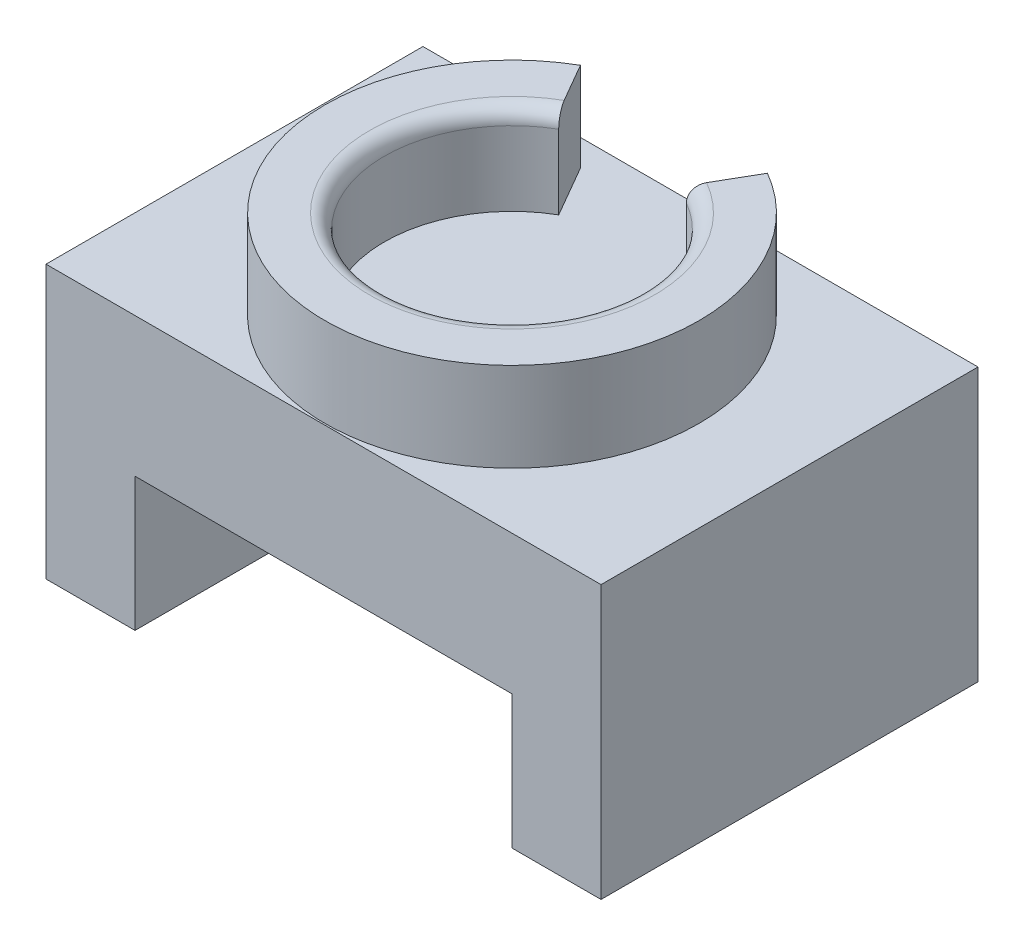
ISO-10303-21;
HEADER;
FILE_DESCRIPTION(('STEP AP214'),'2;1');
FILE_NAME('part.step','',(''),(''),'','','');
FILE_SCHEMA(('AUTOMOTIVE_DESIGN { 1 0 10303 214 1 1 1 1 }'));
ENDSEC;
DATA;
#1=APPLICATION_CONTEXT('core data for automotive mechanical design processes');
#2=APPLICATION_PROTOCOL_DEFINITION('international standard','automotive_design',2000,#1);
#3=PRODUCT_CONTEXT('',#1,'mechanical');
#4=PRODUCT('Part','Part','',(#3));
#5=PRODUCT_RELATED_PRODUCT_CATEGORY('part','',(#4));
#6=PRODUCT_DEFINITION_FORMATION('','',#4);
#7=PRODUCT_DEFINITION_CONTEXT('part definition',#1,'design');
#8=PRODUCT_DEFINITION('design','',#6,#7);
#9=PRODUCT_DEFINITION_SHAPE('','',#8);
#10=(LENGTH_UNIT() NAMED_UNIT(*) SI_UNIT(.MILLI.,.METRE.));
#11=(NAMED_UNIT(*) PLANE_ANGLE_UNIT() SI_UNIT($,.RADIAN.));
#12=(NAMED_UNIT(*) SI_UNIT($,.STERADIAN.) SOLID_ANGLE_UNIT());
#13=UNCERTAINTY_MEASURE_WITH_UNIT(LENGTH_MEASURE(1.E-05),#10,'distance_accuracy_value','');
#14=(GEOMETRIC_REPRESENTATION_CONTEXT(3) GLOBAL_UNCERTAINTY_ASSIGNED_CONTEXT((#13)) GLOBAL_UNIT_ASSIGNED_CONTEXT((#10,
#11,#12)) REPRESENTATION_CONTEXT('',''));
#15=CARTESIAN_POINT('',(0.,0.,0.));
#16=DIRECTION('',(0.,0.,1.));
#17=DIRECTION('',(1.,0.,0.));
#18=AXIS2_PLACEMENT_3D('',#15,#16,#17);
#19=CARTESIAN_POINT('',(2.51046511627907,24.375,12.7));
#20=DIRECTION('',(0.,1.,0.));
#21=DIRECTION('',(-1.,0.,0.));
#22=AXIS2_PLACEMENT_3D('',#19,#20,#21);
#23=PLANE('',#22);
#24=DIRECTION('',(0.500000000000001,0.,-0.866025403784438));
#25=VECTOR('',#24,1.);
#26=CARTESIAN_POINT('',(7.38211015124049,24.375,4.26206328300618));
#27=LINE('',#26,#25);
#28=CARTESIAN_POINT('',(7.31046511627908,24.375,4.38615612366939));
#29=VERTEX_POINT('',#28);
#30=CARTESIAN_POINT('',(8.81046511627909,24.375,1.78807991231608));
#31=VERTEX_POINT('',#30);
#32=EDGE_CURVE('E268',#29,#31,#27,.T.);
#33=ORIENTED_EDGE('',*,*,#32,.F.);
#34=CARTESIAN_POINT('',(2.51046511627907,24.375,12.7));
#35=DIRECTION('',(0.,1.,0.));
#36=DIRECTION('',(-1.,0.,0.));
#37=AXIS2_PLACEMENT_3D('',#34,#35,#36);
#38=CIRCLE('',#37,9.6);
#39=CARTESIAN_POINT('',(-2.28953488372094,24.375,4.38615612366939));
#40=VERTEX_POINT('',#39);
#41=EDGE_CURVE('E48',#29,#40,#38,.F.);
#42=ORIENTED_EDGE('',*,*,#41,.T.);
#43=DIRECTION('',(-0.500000000000001,0.,-0.866025403784438));
#44=VECTOR('',#43,1.);
#45=CARTESIAN_POINT('',(-3.61641247682189,24.375,2.08793671699385));
#46=LINE('',#45,#44);
#47=CARTESIAN_POINT('',(-3.78953488372094,24.375,1.78807991231608));
#48=VERTEX_POINT('',#47);
#49=EDGE_CURVE('E265',#40,#48,#46,.T.);
#50=ORIENTED_EDGE('',*,*,#49,.T.);
#51=CARTESIAN_POINT('',(2.51046511627907,24.375,12.7));
#52=DIRECTION('',(0.,1.,0.));
#53=DIRECTION('',(-1.,0.,0.));
#54=AXIS2_PLACEMENT_3D('',#51,#52,#53);
#55=CIRCLE('',#54,12.6);
#56=EDGE_CURVE('E159',#48,#31,#55,.T.);
#57=ORIENTED_EDGE('',*,*,#56,.T.);
#58=EDGE_LOOP('',(#33,#42,#50,#57));
#59=FACE_BOUND('',#58,.T.);
#60=ADVANCED_FACE('F39',(#59),#23,.T.);
#61=CARTESIAN_POINT('',(2.51046511627907,24.375,12.7));
#62=DIRECTION('',(0.,-1.,0.));
#63=DIRECTION('',(1.,0.,0.));
#64=AXIS2_PLACEMENT_3D('',#61,#62,#63);
#65=CYLINDRICAL_SURFACE('',#64,12.6);
#66=DIRECTION('',(0.,1.,0.));
#67=VECTOR('',#66,1.);
#68=CARTESIAN_POINT('',(-3.78953488372094,18.375,1.78807991231608));
#69=LINE('',#68,#67);
#70=CARTESIAN_POINT('',(-3.78953488372094,18.375,1.78807991231608));
#71=VERTEX_POINT('',#70);
#72=EDGE_CURVE('E160',#71,#48,#69,.T.);
#73=ORIENTED_EDGE('',*,*,#72,.F.);
#74=CARTESIAN_POINT('',(2.51046511627907,18.375,12.7));
#75=DIRECTION('',(0.,-1.,0.));
#76=DIRECTION('',(1.,0.,0.));
#77=AXIS2_PLACEMENT_3D('',#74,#75,#76);
#78=CIRCLE('',#77,12.6);
#79=CARTESIAN_POINT('',(8.81046511627909,18.375,1.78807991231608));
#80=VERTEX_POINT('',#79);
#81=EDGE_CURVE('E252',#71,#80,#78,.F.);
#82=ORIENTED_EDGE('',*,*,#81,.T.);
#83=DIRECTION('',(0.,1.,0.));
#84=VECTOR('',#83,1.);
#85=CARTESIAN_POINT('',(8.81046511627909,18.375,1.78807991231608));
#86=LINE('',#85,#84);
#87=EDGE_CURVE('E136',#80,#31,#86,.T.);
#88=ORIENTED_EDGE('',*,*,#87,.T.);
#89=ORIENTED_EDGE('',*,*,#56,.F.);
#90=EDGE_LOOP('',(#73,#82,#88,#89));
#91=FACE_BOUND('',#90,.T.);
#92=ADVANCED_FACE('F261',(#91),#65,.T.);
#93=CARTESIAN_POINT('',(2.51046511627907,24.375,12.7));
#94=DIRECTION('',(0.,-1.,0.));
#95=DIRECTION('',(1.,0.,0.));
#96=AXIS2_PLACEMENT_3D('',#93,#94,#95);
#97=CYLINDRICAL_SURFACE('',#96,8.6);
#98=DIRECTION('',(0.,1.,0.));
#99=VECTOR('',#98,1.);
#100=CARTESIAN_POINT('',(-1.78953488372094,18.375,5.25218152745383));
#101=LINE('',#100,#99);
#102=CARTESIAN_POINT('',(-1.78953488372094,18.375,5.25218152745383));
#103=VERTEX_POINT('',#102);
#104=CARTESIAN_POINT('',(-1.78953488372094,23.375,5.25218152745383));
#105=VERTEX_POINT('',#104);
#106=EDGE_CURVE('E142',#103,#105,#101,.T.);
#107=ORIENTED_EDGE('',*,*,#106,.T.);
#108=CARTESIAN_POINT('',(2.51046511627907,23.375,12.7));
#109=DIRECTION('',(0.,1.,0.));
#110=DIRECTION('',(-1.,0.,0.));
#111=AXIS2_PLACEMENT_3D('',#108,#109,#110);
#112=CIRCLE('',#111,8.6);
#113=CARTESIAN_POINT('',(6.81046511627908,23.375,5.25218152745383));
#114=VERTEX_POINT('',#113);
#115=EDGE_CURVE('E152',#105,#114,#112,.T.);
#116=ORIENTED_EDGE('',*,*,#115,.T.);
#117=DIRECTION('',(0.,1.,0.));
#118=VECTOR('',#117,1.);
#119=CARTESIAN_POINT('',(6.81046511627908,18.375,5.25218152745383));
#120=LINE('',#119,#118);
#121=CARTESIAN_POINT('',(6.81046511627908,18.375,5.25218152745383));
#122=VERTEX_POINT('',#121);
#123=EDGE_CURVE('E134',#122,#114,#120,.T.);
#124=ORIENTED_EDGE('',*,*,#123,.F.);
#125=CARTESIAN_POINT('',(2.51046511627907,18.375,12.7));
#126=DIRECTION('',(0.,1.,0.));
#127=DIRECTION('',(-1.,0.,0.));
#128=AXIS2_PLACEMENT_3D('',#125,#126,#127);
#129=CIRCLE('',#128,8.6);
#130=EDGE_CURVE('E150',#103,#122,#129,.T.);
#131=ORIENTED_EDGE('',*,*,#130,.F.);
#132=EDGE_LOOP('',(#107,#116,#124,#131));
#133=FACE_BOUND('',#132,.T.);
#134=ADVANCED_FACE('F149',(#133),#97,.F.);
#135=CARTESIAN_POINT('',(-16.1895348837209,0.,25.4));
#136=DIRECTION('',(0.,1.,0.));
#137=DIRECTION('',(0.,0.,1.));
#138=AXIS2_PLACEMENT_3D('',#135,#136,#137);
#139=PLANE('',#138);
#140=DIRECTION('',(1.,0.,0.));
#141=VECTOR('',#140,1.);
#142=CARTESIAN_POINT('',(-16.1895348837209,0.,0.));
#143=LINE('',#142,#141);
#144=CARTESIAN_POINT('',(-16.1895348837209,0.,0.));
#145=VERTEX_POINT('',#144);
#146=CARTESIAN_POINT('',(-10.1895348837209,0.,0.));
#147=VERTEX_POINT('',#146);
#148=EDGE_CURVE('E165',#145,#147,#143,.T.);
#149=ORIENTED_EDGE('',*,*,#148,.T.);
#150=DIRECTION('',(0.,0.,-1.));
#151=VECTOR('',#150,1.);
#152=CARTESIAN_POINT('',(-10.1895348837209,0.,25.4));
#153=LINE('',#152,#151);
#154=CARTESIAN_POINT('',(-10.1895348837209,0.,25.4));
#155=VERTEX_POINT('',#154);
#156=EDGE_CURVE('E248',#155,#147,#153,.T.);
#157=ORIENTED_EDGE('',*,*,#156,.F.);
#158=DIRECTION('',(1.,0.,0.));
#159=VECTOR('',#158,1.);
#160=CARTESIAN_POINT('',(-16.1895348837209,0.,25.4));
#161=LINE('',#160,#159);
#162=CARTESIAN_POINT('',(-16.1895348837209,0.,25.4));
#163=VERTEX_POINT('',#162);
#164=EDGE_CURVE('E171',#163,#155,#161,.T.);
#165=ORIENTED_EDGE('',*,*,#164,.F.);
#166=DIRECTION('',(0.,0.,-1.));
#167=VECTOR('',#166,1.);
#168=CARTESIAN_POINT('',(-16.1895348837209,0.,25.4));
#169=LINE('',#168,#167);
#170=EDGE_CURVE('E197',#163,#145,#169,.T.);
#171=ORIENTED_EDGE('',*,*,#170,.T.);
#172=EDGE_LOOP('',(#149,#157,#165,#171));
#173=FACE_BOUND('',#172,.T.);
#174=ADVANCED_FACE('F324',(#173),#139,.F.);
#175=CARTESIAN_POINT('',(-10.1895348837209,0.,25.4));
#176=DIRECTION('',(-1.,0.,0.));
#177=DIRECTION('',(0.,0.,1.));
#178=AXIS2_PLACEMENT_3D('',#175,#176,#177);
#179=PLANE('',#178);
#180=DIRECTION('',(0.,1.,0.));
#181=VECTOR('',#180,1.);
#182=CARTESIAN_POINT('',(-10.1895348837209,0.,0.));
#183=LINE('',#182,#181);
#184=CARTESIAN_POINT('',(-10.1895348837209,9.,0.));
#185=VERTEX_POINT('',#184);
#186=EDGE_CURVE('E201',#147,#185,#183,.T.);
#187=ORIENTED_EDGE('',*,*,#186,.T.);
#188=DIRECTION('',(0.,0.,-1.));
#189=VECTOR('',#188,1.);
#190=CARTESIAN_POINT('',(-10.1895348837209,9.,25.4));
#191=LINE('',#190,#189);
#192=CARTESIAN_POINT('',(-10.1895348837209,9.,25.4));
#193=VERTEX_POINT('',#192);
#194=EDGE_CURVE('E244',#193,#185,#191,.T.);
#195=ORIENTED_EDGE('',*,*,#194,.F.);
#196=DIRECTION('',(0.,1.,0.));
#197=VECTOR('',#196,1.);
#198=CARTESIAN_POINT('',(-10.1895348837209,0.,25.4));
#199=LINE('',#198,#197);
#200=EDGE_CURVE('E175',#155,#193,#199,.T.);
#201=ORIENTED_EDGE('',*,*,#200,.F.);
#202=ORIENTED_EDGE('',*,*,#156,.T.);
#203=EDGE_LOOP('',(#187,#195,#201,#202));
#204=FACE_BOUND('',#203,.T.);
#205=ADVANCED_FACE('F321',(#204),#179,.F.);
#206=CARTESIAN_POINT('',(-10.1895348837209,9.,25.4));
#207=DIRECTION('',(0.,1.,0.));
#208=DIRECTION('',(0.,0.,1.));
#209=AXIS2_PLACEMENT_3D('',#206,#207,#208);
#210=PLANE('',#209);
#211=DIRECTION('',(1.,0.,0.));
#212=VECTOR('',#211,1.);
#213=CARTESIAN_POINT('',(-10.1895348837209,9.,0.));
#214=LINE('',#213,#212);
#215=CARTESIAN_POINT('',(15.2104651162791,9.,0.));
#216=VERTEX_POINT('',#215);
#217=EDGE_CURVE('E204',#185,#216,#214,.T.);
#218=ORIENTED_EDGE('',*,*,#217,.T.);
#219=DIRECTION('',(0.,0.,-1.));
#220=VECTOR('',#219,1.);
#221=CARTESIAN_POINT('',(15.2104651162791,9.,25.4));
#222=LINE('',#221,#220);
#223=CARTESIAN_POINT('',(15.2104651162791,9.,25.4));
#224=VERTEX_POINT('',#223);
#225=EDGE_CURVE('E240',#224,#216,#222,.T.);
#226=ORIENTED_EDGE('',*,*,#225,.F.);
#227=DIRECTION('',(1.,0.,0.));
#228=VECTOR('',#227,1.);
#229=CARTESIAN_POINT('',(-10.1895348837209,9.,25.4));
#230=LINE('',#229,#228);
#231=EDGE_CURVE('E179',#193,#224,#230,.T.);
#232=ORIENTED_EDGE('',*,*,#231,.F.);
#233=ORIENTED_EDGE('',*,*,#194,.T.);
#234=EDGE_LOOP('',(#218,#226,#232,#233));
#235=FACE_BOUND('',#234,.T.);
#236=ADVANCED_FACE('F317',(#235),#210,.F.);
#237=CARTESIAN_POINT('',(15.2104651162791,9.,25.4));
#238=DIRECTION('',(1.,0.,0.));
#239=DIRECTION('',(0.,1.,0.));
#240=AXIS2_PLACEMENT_3D('',#237,#238,#239);
#241=PLANE('',#240);
#242=DIRECTION('',(0.,-1.,0.));
#243=VECTOR('',#242,1.);
#244=CARTESIAN_POINT('',(15.2104651162791,9.,0.));
#245=LINE('',#244,#243);
#246=CARTESIAN_POINT('',(15.2104651162791,0.,0.));
#247=VERTEX_POINT('',#246);
#248=EDGE_CURVE('E207',#216,#247,#245,.T.);
#249=ORIENTED_EDGE('',*,*,#248,.T.);
#250=DIRECTION('',(0.,0.,-1.));
#251=VECTOR('',#250,1.);
#252=CARTESIAN_POINT('',(15.2104651162791,0.,25.4));
#253=LINE('',#252,#251);
#254=CARTESIAN_POINT('',(15.2104651162791,0.,25.4));
#255=VERTEX_POINT('',#254);
#256=EDGE_CURVE('E236',#255,#247,#253,.T.);
#257=ORIENTED_EDGE('',*,*,#256,.F.);
#258=DIRECTION('',(0.,-1.,0.));
#259=VECTOR('',#258,1.);
#260=CARTESIAN_POINT('',(15.2104651162791,9.,25.4));
#261=LINE('',#260,#259);
#262=EDGE_CURVE('E182',#224,#255,#261,.T.);
#263=ORIENTED_EDGE('',*,*,#262,.F.);
#264=ORIENTED_EDGE('',*,*,#225,.T.);
#265=EDGE_LOOP('',(#249,#257,#263,#264));
#266=FACE_BOUND('',#265,.T.);
#267=ADVANCED_FACE('F313',(#266),#241,.F.);
#268=CARTESIAN_POINT('',(15.2104651162791,0.,25.4));
#269=DIRECTION('',(0.,1.,0.));
#270=DIRECTION('',(0.,0.,1.));
#271=AXIS2_PLACEMENT_3D('',#268,#269,#270);
#272=PLANE('',#271);
#273=DIRECTION('',(1.,0.,0.));
#274=VECTOR('',#273,1.);
#275=CARTESIAN_POINT('',(15.2104651162791,0.,0.));
#276=LINE('',#275,#274);
#277=CARTESIAN_POINT('',(21.2104651162791,0.,0.));
#278=VERTEX_POINT('',#277);
#279=EDGE_CURVE('E210',#247,#278,#276,.T.);
#280=ORIENTED_EDGE('',*,*,#279,.T.);
#281=DIRECTION('',(0.,0.,-1.));
#282=VECTOR('',#281,1.);
#283=CARTESIAN_POINT('',(21.2104651162791,0.,25.4));
#284=LINE('',#283,#282);
#285=CARTESIAN_POINT('',(21.2104651162791,0.,25.4));
#286=VERTEX_POINT('',#285);
#287=EDGE_CURVE('E232',#286,#278,#284,.T.);
#288=ORIENTED_EDGE('',*,*,#287,.F.);
#289=DIRECTION('',(1.,0.,0.));
#290=VECTOR('',#289,1.);
#291=CARTESIAN_POINT('',(15.2104651162791,0.,25.4));
#292=LINE('',#291,#290);
#293=EDGE_CURVE('E185',#255,#286,#292,.T.);
#294=ORIENTED_EDGE('',*,*,#293,.F.);
#295=ORIENTED_EDGE('',*,*,#256,.T.);
#296=EDGE_LOOP('',(#280,#288,#294,#295));
#297=FACE_BOUND('',#296,.T.);
#298=ADVANCED_FACE('F309',(#297),#272,.F.);
#299=CARTESIAN_POINT('',(21.2104651162791,0.,25.4));
#300=DIRECTION('',(-1.,0.,0.));
#301=DIRECTION('',(0.,0.,1.));
#302=AXIS2_PLACEMENT_3D('',#299,#300,#301);
#303=PLANE('',#302);
#304=DIRECTION('',(0.,1.,0.));
#305=VECTOR('',#304,1.);
#306=CARTESIAN_POINT('',(21.2104651162791,0.,0.));
#307=LINE('',#306,#305);
#308=CARTESIAN_POINT('',(21.2104651162791,18.375,0.));
#309=VERTEX_POINT('',#308);
#310=EDGE_CURVE('E213',#278,#309,#307,.T.);
#311=ORIENTED_EDGE('',*,*,#310,.T.);
#312=DIRECTION('',(0.,0.,-1.));
#313=VECTOR('',#312,1.);
#314=CARTESIAN_POINT('',(21.2104651162791,18.375,25.4));
#315=LINE('',#314,#313);
#316=CARTESIAN_POINT('',(21.2104651162791,18.375,25.4));
#317=VERTEX_POINT('',#316);
#318=EDGE_CURVE('E228',#317,#309,#315,.T.);
#319=ORIENTED_EDGE('',*,*,#318,.F.);
#320=DIRECTION('',(0.,1.,0.));
#321=VECTOR('',#320,1.);
#322=CARTESIAN_POINT('',(21.2104651162791,0.,25.4));
#323=LINE('',#322,#321);
#324=EDGE_CURVE('E188',#286,#317,#323,.T.);
#325=ORIENTED_EDGE('',*,*,#324,.F.);
#326=ORIENTED_EDGE('',*,*,#287,.T.);
#327=EDGE_LOOP('',(#311,#319,#325,#326));
#328=FACE_BOUND('',#327,.T.);
#329=ADVANCED_FACE('F306',(#328),#303,.F.);
#330=CARTESIAN_POINT('',(21.2104651162791,18.375,25.4));
#331=DIRECTION('',(0.,-1.,0.));
#332=DIRECTION('',(1.,0.,0.));
#333=AXIS2_PLACEMENT_3D('',#330,#331,#332);
#334=PLANE('',#333);
#335=ORIENTED_EDGE('',*,*,#81,.F.);
#336=DIRECTION('',(-0.500000000000001,0.,-0.866025403784438));
#337=VECTOR('',#336,1.);
#338=CARTESIAN_POINT('',(-3.61641247682189,18.375,2.08793671699385));
#339=LINE('',#338,#337);
#340=EDGE_CURVE('E143',#103,#71,#339,.T.);
#341=ORIENTED_EDGE('',*,*,#340,.F.);
#342=ORIENTED_EDGE('',*,*,#130,.T.);
#343=DIRECTION('',(0.500000000000001,0.,-0.866025403784438));
#344=VECTOR('',#343,1.);
#345=CARTESIAN_POINT('',(7.38211015124049,18.375,4.26206328300618));
#346=LINE('',#345,#344);
#347=EDGE_CURVE('E131',#122,#80,#346,.T.);
#348=ORIENTED_EDGE('',*,*,#347,.T.);
#349=EDGE_LOOP('',(#335,#341,#342,#348));
#350=FACE_BOUND('',#349,.T.);
#351=DIRECTION('',(-1.,0.,0.));
#352=VECTOR('',#351,1.);
#353=CARTESIAN_POINT('',(21.2104651162791,18.375,0.));
#354=LINE('',#353,#352);
#355=CARTESIAN_POINT('',(-16.1895348837209,18.375,0.));
#356=VERTEX_POINT('',#355);
#357=EDGE_CURVE('E216',#309,#356,#354,.T.);
#358=ORIENTED_EDGE('',*,*,#357,.T.);
#359=DIRECTION('',(0.,0.,-1.));
#360=VECTOR('',#359,1.);
#361=CARTESIAN_POINT('',(-16.1895348837209,18.375,25.4));
#362=LINE('',#361,#360);
#363=CARTESIAN_POINT('',(-16.1895348837209,18.375,25.4));
#364=VERTEX_POINT('',#363);
#365=EDGE_CURVE('E224',#364,#356,#362,.T.);
#366=ORIENTED_EDGE('',*,*,#365,.F.);
#367=DIRECTION('',(-1.,0.,0.));
#368=VECTOR('',#367,1.);
#369=CARTESIAN_POINT('',(21.2104651162791,18.375,25.4));
#370=LINE('',#369,#368);
#371=EDGE_CURVE('E191',#317,#364,#370,.T.);
#372=ORIENTED_EDGE('',*,*,#371,.F.);
#373=ORIENTED_EDGE('',*,*,#318,.T.);
#374=EDGE_LOOP('',(#358,#366,#372,#373));
#375=FACE_BOUND('',#374,.T.);
#376=ADVANCED_FACE('F155',(#350,#375),#334,.F.);
#377=CARTESIAN_POINT('',(-16.1895348837209,18.375,25.4));
#378=DIRECTION('',(1.,0.,0.));
#379=DIRECTION('',(0.,1.,0.));
#380=AXIS2_PLACEMENT_3D('',#377,#378,#379);
#381=PLANE('',#380);
#382=DIRECTION('',(0.,-1.,0.));
#383=VECTOR('',#382,1.);
#384=CARTESIAN_POINT('',(-16.1895348837209,18.375,0.));
#385=LINE('',#384,#383);
#386=EDGE_CURVE('E176',#356,#145,#385,.T.);
#387=ORIENTED_EDGE('',*,*,#386,.T.);
#388=ORIENTED_EDGE('',*,*,#170,.F.);
#389=DIRECTION('',(0.,-1.,0.));
#390=VECTOR('',#389,1.);
#391=CARTESIAN_POINT('',(-16.1895348837209,18.375,25.4));
#392=LINE('',#391,#390);
#393=EDGE_CURVE('E194',#364,#163,#392,.T.);
#394=ORIENTED_EDGE('',*,*,#393,.F.);
#395=ORIENTED_EDGE('',*,*,#365,.T.);
#396=EDGE_LOOP('',(#387,#388,#394,#395));
#397=FACE_BOUND('',#396,.T.);
#398=ADVANCED_FACE('F296',(#397),#381,.F.);
#399=CARTESIAN_POINT('',(0.,0.,25.4));
#400=DIRECTION('',(0.,0.,1.));
#401=DIRECTION('',(1.,0.,0.));
#402=AXIS2_PLACEMENT_3D('',#399,#400,#401);
#403=PLANE('',#402);
#404=ORIENTED_EDGE('',*,*,#164,.T.);
#405=ORIENTED_EDGE('',*,*,#200,.T.);
#406=ORIENTED_EDGE('',*,*,#231,.T.);
#407=ORIENTED_EDGE('',*,*,#262,.T.);
#408=ORIENTED_EDGE('',*,*,#293,.T.);
#409=ORIENTED_EDGE('',*,*,#324,.T.);
#410=ORIENTED_EDGE('',*,*,#371,.T.);
#411=ORIENTED_EDGE('',*,*,#393,.T.);
#412=EDGE_LOOP('',(#404,#405,#406,#407,#408,#409,#410,#411));
#413=FACE_BOUND('',#412,.T.);
#414=ADVANCED_FACE('F292',(#413),#403,.T.);
#415=CARTESIAN_POINT('',(0.,0.,0.));
#416=DIRECTION('',(0.,0.,1.));
#417=DIRECTION('',(1.,0.,0.));
#418=AXIS2_PLACEMENT_3D('',#415,#416,#417);
#419=PLANE('',#418);
#420=ORIENTED_EDGE('',*,*,#148,.F.);
#421=ORIENTED_EDGE('',*,*,#386,.F.);
#422=ORIENTED_EDGE('',*,*,#357,.F.);
#423=ORIENTED_EDGE('',*,*,#310,.F.);
#424=ORIENTED_EDGE('',*,*,#279,.F.);
#425=ORIENTED_EDGE('',*,*,#248,.F.);
#426=ORIENTED_EDGE('',*,*,#217,.F.);
#427=ORIENTED_EDGE('',*,*,#186,.F.);
#428=EDGE_LOOP('',(#420,#421,#422,#423,#424,#425,#426,#427));
#429=FACE_BOUND('',#428,.T.);
#430=ADVANCED_FACE('F295',(#429),#419,.F.);
#431=CARTESIAN_POINT('',(-3.61641247682189,18.375,2.08793671699385));
#432=DIRECTION('',(0.866025403784438,0.,-0.500000000000001));
#433=DIRECTION('',(-0.500000000000001,0.,-0.866025403784438));
#434=AXIS2_PLACEMENT_3D('',#431,#432,#433);
#435=PLANE('',#434);
#436=ORIENTED_EDGE('',*,*,#49,.F.);
#437=CARTESIAN_POINT('',(-2.28953488372094,23.375,4.38615612366939));
#438=DIRECTION('',(0.866025403784438,0.,-0.500000000000001));
#439=DIRECTION('',(-0.500000000000001,0.,-0.866025403784438));
#440=AXIS2_PLACEMENT_3D('',#437,#438,#439);
#441=CIRCLE('',#440,1.);
#442=EDGE_CURVE('E11',#40,#105,#441,.T.);
#443=ORIENTED_EDGE('',*,*,#442,.T.);
#444=ORIENTED_EDGE('',*,*,#106,.F.);
#445=ORIENTED_EDGE('',*,*,#340,.T.);
#446=ORIENTED_EDGE('',*,*,#72,.T.);
#447=EDGE_LOOP('',(#436,#443,#444,#445,#446));
#448=FACE_BOUND('',#447,.T.);
#449=ADVANCED_FACE('F264',(#448),#435,.T.);
#450=CARTESIAN_POINT('',(7.38211015124049,18.375,4.26206328300618));
#451=DIRECTION('',(0.866025403784438,0.,0.500000000000001));
#452=DIRECTION('',(0.500000000000001,0.,-0.866025403784438));
#453=AXIS2_PLACEMENT_3D('',#450,#451,#452);
#454=PLANE('',#453);
#455=ORIENTED_EDGE('',*,*,#123,.T.);
#456=CARTESIAN_POINT('',(7.31046511627908,23.375,4.38615612366939));
#457=DIRECTION('',(0.866025403784438,0.,0.500000000000001));
#458=DIRECTION('',(0.500000000000001,0.,-0.866025403784438));
#459=AXIS2_PLACEMENT_3D('',#456,#457,#458);
#460=CIRCLE('',#459,1.);
#461=EDGE_CURVE('E62',#114,#29,#460,.F.);
#462=ORIENTED_EDGE('',*,*,#461,.T.);
#463=ORIENTED_EDGE('',*,*,#32,.T.);
#464=ORIENTED_EDGE('',*,*,#87,.F.);
#465=ORIENTED_EDGE('',*,*,#347,.F.);
#466=EDGE_LOOP('',(#455,#462,#463,#464,#465));
#467=FACE_BOUND('',#466,.T.);
#468=ADVANCED_FACE('F133',(#467),#454,.F.);
#469=CARTESIAN_POINT('',(2.51046511627907,23.375,12.7));
#470=DIRECTION('',(0.,1.,0.));
#471=DIRECTION('',(-1.,0.,0.));
#472=AXIS2_PLACEMENT_3D('',#469,#470,#471);
#473=TOROIDAL_SURFACE('',#472,9.6,1.);
#474=ORIENTED_EDGE('',*,*,#442,.F.);
#475=ORIENTED_EDGE('',*,*,#41,.F.);
#476=ORIENTED_EDGE('',*,*,#461,.F.);
#477=ORIENTED_EDGE('',*,*,#115,.F.);
#478=EDGE_LOOP('',(#474,#475,#476,#477));
#479=FACE_BOUND('',#478,.T.);
#480=ADVANCED_FACE('F41',(#479),#473,.T.);
#481=CLOSED_SHELL('',(#60,#92,#134,#174,#205,#236,#267,#298,#329,#376,#398,#414,#430,#449,#468,#480));
#482=MANIFOLD_SOLID_BREP('B2',#481);
#483=ADVANCED_BREP_SHAPE_REPRESENTATION('',(#18,#482),#14);
#484=SHAPE_DEFINITION_REPRESENTATION(#9,#483);
ENDSEC;
END-ISO-10303-21;
